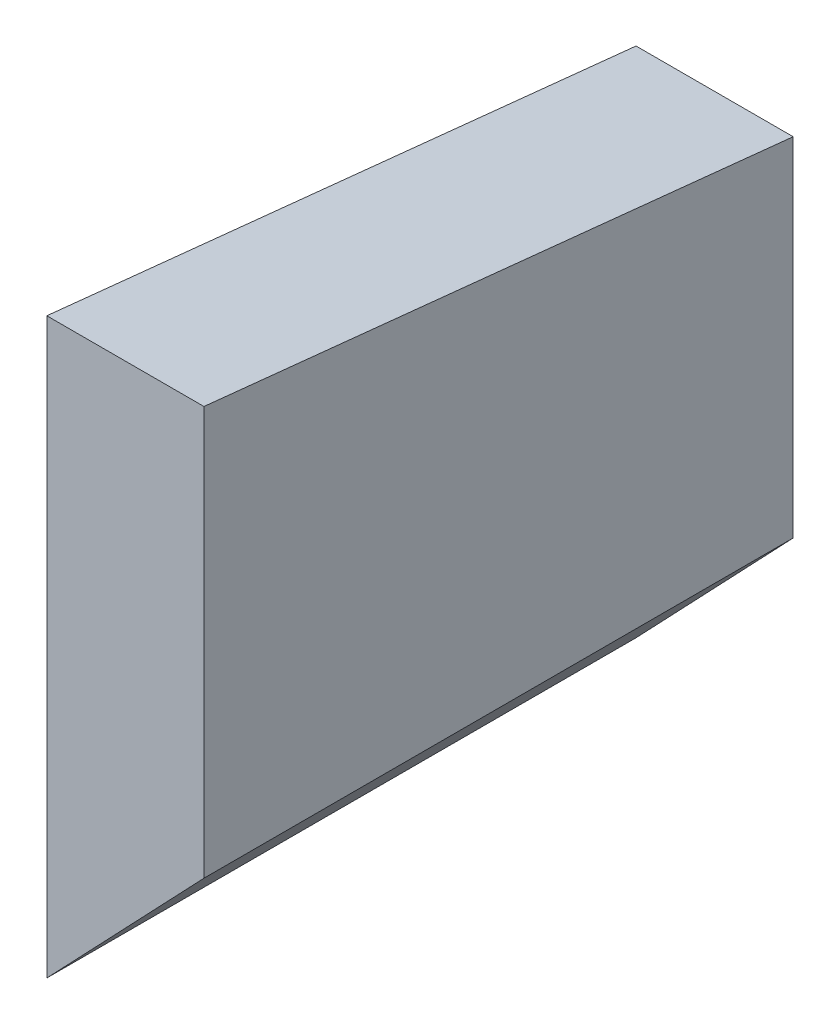
ISO-10303-21;
HEADER;
FILE_DESCRIPTION(('STEP AP214'),'2;1');
FILE_NAME('part.step','',(''),(''),'','','');
FILE_SCHEMA(('AUTOMOTIVE_DESIGN { 1 0 10303 214 1 1 1 1 }'));
ENDSEC;
DATA;
#1=APPLICATION_CONTEXT('core data for automotive mechanical design processes');
#2=APPLICATION_PROTOCOL_DEFINITION('international standard','automotive_design',2000,#1);
#3=PRODUCT_CONTEXT('',#1,'mechanical');
#4=PRODUCT('Part','Part','',(#3));
#5=PRODUCT_RELATED_PRODUCT_CATEGORY('part','',(#4));
#6=PRODUCT_DEFINITION_FORMATION('','',#4);
#7=PRODUCT_DEFINITION_CONTEXT('part definition',#1,'design');
#8=PRODUCT_DEFINITION('design','',#6,#7);
#9=PRODUCT_DEFINITION_SHAPE('','',#8);
#10=(LENGTH_UNIT() NAMED_UNIT(*) SI_UNIT(.MILLI.,.METRE.));
#11=(NAMED_UNIT(*) PLANE_ANGLE_UNIT() SI_UNIT($,.RADIAN.));
#12=(NAMED_UNIT(*) SI_UNIT($,.STERADIAN.) SOLID_ANGLE_UNIT());
#13=UNCERTAINTY_MEASURE_WITH_UNIT(LENGTH_MEASURE(1.E-05),#10,'distance_accuracy_value','');
#14=(GEOMETRIC_REPRESENTATION_CONTEXT(3) GLOBAL_UNCERTAINTY_ASSIGNED_CONTEXT((#13)) GLOBAL_UNIT_ASSIGNED_CONTEXT((#10,
#11,#12)) REPRESENTATION_CONTEXT('',''));
#15=CARTESIAN_POINT('',(0.,0.,0.));
#16=DIRECTION('',(0.,0.,1.));
#17=DIRECTION('',(1.,0.,0.));
#18=AXIS2_PLACEMENT_3D('',#15,#16,#17);
#19=CARTESIAN_POINT('',(-2.54,-20.828,0.));
#20=DIRECTION('',(-1.,0.,0.));
#21=DIRECTION('',(0.,0.,1.));
#22=AXIS2_PLACEMENT_3D('',#19,#20,#21);
#23=PLANE('',#22);
#24=DIRECTION('',(0.,1.,0.));
#25=VECTOR('',#24,1.);
#26=CARTESIAN_POINT('',(-2.54,-20.828,0.));
#27=LINE('',#26,#25);
#28=CARTESIAN_POINT('',(-2.54,-18.542,0.));
#29=VERTEX_POINT('',#28);
#30=CARTESIAN_POINT('',(-2.54,-1.97198641718141,0.));
#31=VERTEX_POINT('',#30);
#32=EDGE_CURVE('E11',#29,#31,#27,.T.);
#33=ORIENTED_EDGE('',*,*,#32,.F.);
#34=DIRECTION('',(0.,0.,1.));
#35=VECTOR('',#34,1.);
#36=CARTESIAN_POINT('',(-2.54,-18.542,0.));
#37=LINE('',#36,#35);
#38=CARTESIAN_POINT('',(-2.54,-18.542,19.05));
#39=VERTEX_POINT('',#38);
#40=EDGE_CURVE('E72',#29,#39,#37,.T.);
#41=ORIENTED_EDGE('',*,*,#40,.T.);
#42=DIRECTION('',(0.,1.,0.));
#43=VECTOR('',#42,1.);
#44=CARTESIAN_POINT('',(-2.54,-20.828,19.05));
#45=LINE('',#44,#43);
#46=CARTESIAN_POINT('',(-2.54,0.,19.05));
#47=VERTEX_POINT('',#46);
#48=EDGE_CURVE('E36',#39,#47,#45,.T.);
#49=ORIENTED_EDGE('',*,*,#48,.T.);
#50=DIRECTION('',(0.,-0.102966143613117,-0.994684861284941));
#51=VECTOR('',#50,1.);
#52=CARTESIAN_POINT('',(-2.54,-1.97198641718141,0.));
#53=LINE('',#52,#51);
#54=EDGE_CURVE('E85',#47,#31,#53,.T.);
#55=ORIENTED_EDGE('',*,*,#54,.T.);
#56=EDGE_LOOP('',(#33,#41,#49,#55));
#57=FACE_BOUND('',#56,.T.);
#58=ADVANCED_FACE('F33',(#57),#23,.T.);
#59=CARTESIAN_POINT('',(-2.54,-20.828,0.));
#60=DIRECTION('',(0.,0.,-1.));
#61=DIRECTION('',(-1.,0.,0.));
#62=AXIS2_PLACEMENT_3D('',#59,#60,#61);
#63=PLANE('',#62);
#64=DIRECTION('',(0.,1.,0.));
#65=VECTOR('',#64,1.);
#66=CARTESIAN_POINT('',(2.54,-20.828,0.));
#67=LINE('',#66,#65);
#68=CARTESIAN_POINT('',(2.54,-13.208,0.));
#69=VERTEX_POINT('',#68);
#70=CARTESIAN_POINT('',(2.54,-1.97198641718141,0.));
#71=VERTEX_POINT('',#70);
#72=EDGE_CURVE('E41',#69,#71,#67,.T.);
#73=ORIENTED_EDGE('',*,*,#72,.F.);
#74=DIRECTION('',(0.689655172413793,0.724137931034483,0.));
#75=VECTOR('',#74,1.);
#76=CARTESIAN_POINT('',(7.92806183115339,-7.55053507728894,0.));
#77=LINE('',#76,#75);
#78=EDGE_CURVE('E75',#29,#69,#77,.T.);
#79=ORIENTED_EDGE('',*,*,#78,.F.);
#80=ORIENTED_EDGE('',*,*,#32,.T.);
#81=DIRECTION('',(1.,0.,0.));
#82=VECTOR('',#81,1.);
#83=CARTESIAN_POINT('',(-2.54,-1.97198641718141,0.));
#84=LINE('',#83,#82);
#85=EDGE_CURVE('E89',#31,#71,#84,.T.);
#86=ORIENTED_EDGE('',*,*,#85,.T.);
#87=EDGE_LOOP('',(#73,#79,#80,#86));
#88=FACE_BOUND('',#87,.T.);
#89=ADVANCED_FACE('F81',(#88),#63,.T.);
#90=CARTESIAN_POINT('',(2.54,-20.828,0.));
#91=DIRECTION('',(1.,0.,0.));
#92=DIRECTION('',(0.,0.,-1.));
#93=AXIS2_PLACEMENT_3D('',#90,#91,#92);
#94=PLANE('',#93);
#95=DIRECTION('',(0.,1.,0.));
#96=VECTOR('',#95,1.);
#97=CARTESIAN_POINT('',(2.54,-20.828,19.05));
#98=LINE('',#97,#96);
#99=CARTESIAN_POINT('',(2.54,-13.208,19.05));
#100=VERTEX_POINT('',#99);
#101=CARTESIAN_POINT('',(2.54,0.,19.05));
#102=VERTEX_POINT('',#101);
#103=EDGE_CURVE('E99',#100,#102,#98,.T.);
#104=ORIENTED_EDGE('',*,*,#103,.F.);
#105=DIRECTION('',(0.,0.,1.));
#106=VECTOR('',#105,1.);
#107=CARTESIAN_POINT('',(2.54,-13.208,0.));
#108=LINE('',#107,#106);
#109=EDGE_CURVE('E49',#69,#100,#108,.T.);
#110=ORIENTED_EDGE('',*,*,#109,.F.);
#111=ORIENTED_EDGE('',*,*,#72,.T.);
#112=DIRECTION('',(0.,-0.102966143613117,-0.994684861284941));
#113=VECTOR('',#112,1.);
#114=CARTESIAN_POINT('',(2.54,-1.97198641718141,0.));
#115=LINE('',#114,#113);
#116=EDGE_CURVE('E90',#102,#71,#115,.T.);
#117=ORIENTED_EDGE('',*,*,#116,.F.);
#118=EDGE_LOOP('',(#104,#110,#111,#117));
#119=FACE_BOUND('',#118,.T.);
#120=ADVANCED_FACE('F106',(#119),#94,.T.);
#121=CARTESIAN_POINT('',(-2.54,-20.828,19.05));
#122=DIRECTION('',(0.,0.,1.));
#123=DIRECTION('',(1.,0.,0.));
#124=AXIS2_PLACEMENT_3D('',#121,#122,#123);
#125=PLANE('',#124);
#126=ORIENTED_EDGE('',*,*,#48,.F.);
#127=DIRECTION('',(0.689655172413793,0.724137931034483,0.));
#128=VECTOR('',#127,1.);
#129=CARTESIAN_POINT('',(7.92806183115339,-7.55053507728894,19.05));
#130=LINE('',#129,#128);
#131=EDGE_CURVE('E76',#39,#100,#130,.T.);
#132=ORIENTED_EDGE('',*,*,#131,.T.);
#133=ORIENTED_EDGE('',*,*,#103,.T.);
#134=DIRECTION('',(1.,0.,0.));
#135=VECTOR('',#134,1.);
#136=CARTESIAN_POINT('',(-2.54,0.,19.05));
#137=LINE('',#136,#135);
#138=EDGE_CURVE('E92',#47,#102,#137,.T.);
#139=ORIENTED_EDGE('',*,*,#138,.F.);
#140=EDGE_LOOP('',(#126,#132,#133,#139));
#141=FACE_BOUND('',#140,.T.);
#142=ADVANCED_FACE('F102',(#141),#125,.T.);
#143=CARTESIAN_POINT('',(-2.54,-1.97198641718141,0.));
#144=DIRECTION('',(0.,-0.994684861284941,0.102966143613117));
#145=DIRECTION('',(0.,-0.102966143613117,-0.994684861284941));
#146=AXIS2_PLACEMENT_3D('',#143,#144,#145);
#147=PLANE('',#146);
#148=ORIENTED_EDGE('',*,*,#116,.T.);
#149=ORIENTED_EDGE('',*,*,#85,.F.);
#150=ORIENTED_EDGE('',*,*,#54,.F.);
#151=ORIENTED_EDGE('',*,*,#138,.T.);
#152=EDGE_LOOP('',(#148,#149,#150,#151));
#153=FACE_BOUND('',#152,.T.);
#154=ADVANCED_FACE('F105',(#153),#147,.F.);
#155=CARTESIAN_POINT('',(7.92806183115339,-7.55053507728894,0.));
#156=DIRECTION('',(0.724137931034483,-0.689655172413793,0.));
#157=DIRECTION('',(0.689655172413793,0.724137931034483,0.));
#158=AXIS2_PLACEMENT_3D('',#155,#156,#157);
#159=PLANE('',#158);
#160=ORIENTED_EDGE('',*,*,#131,.F.);
#161=ORIENTED_EDGE('',*,*,#40,.F.);
#162=ORIENTED_EDGE('',*,*,#78,.T.);
#163=ORIENTED_EDGE('',*,*,#109,.T.);
#164=EDGE_LOOP('',(#160,#161,#162,#163));
#165=FACE_BOUND('',#164,.T.);
#166=ADVANCED_FACE('F74',(#165),#159,.T.);
#167=CLOSED_SHELL('',(#58,#89,#120,#142,#154,#166));
#168=MANIFOLD_SOLID_BREP('B2',#167);
#169=ADVANCED_BREP_SHAPE_REPRESENTATION('',(#18,#168),#14);
#170=SHAPE_DEFINITION_REPRESENTATION(#9,#169);
ENDSEC;
END-ISO-10303-21;
